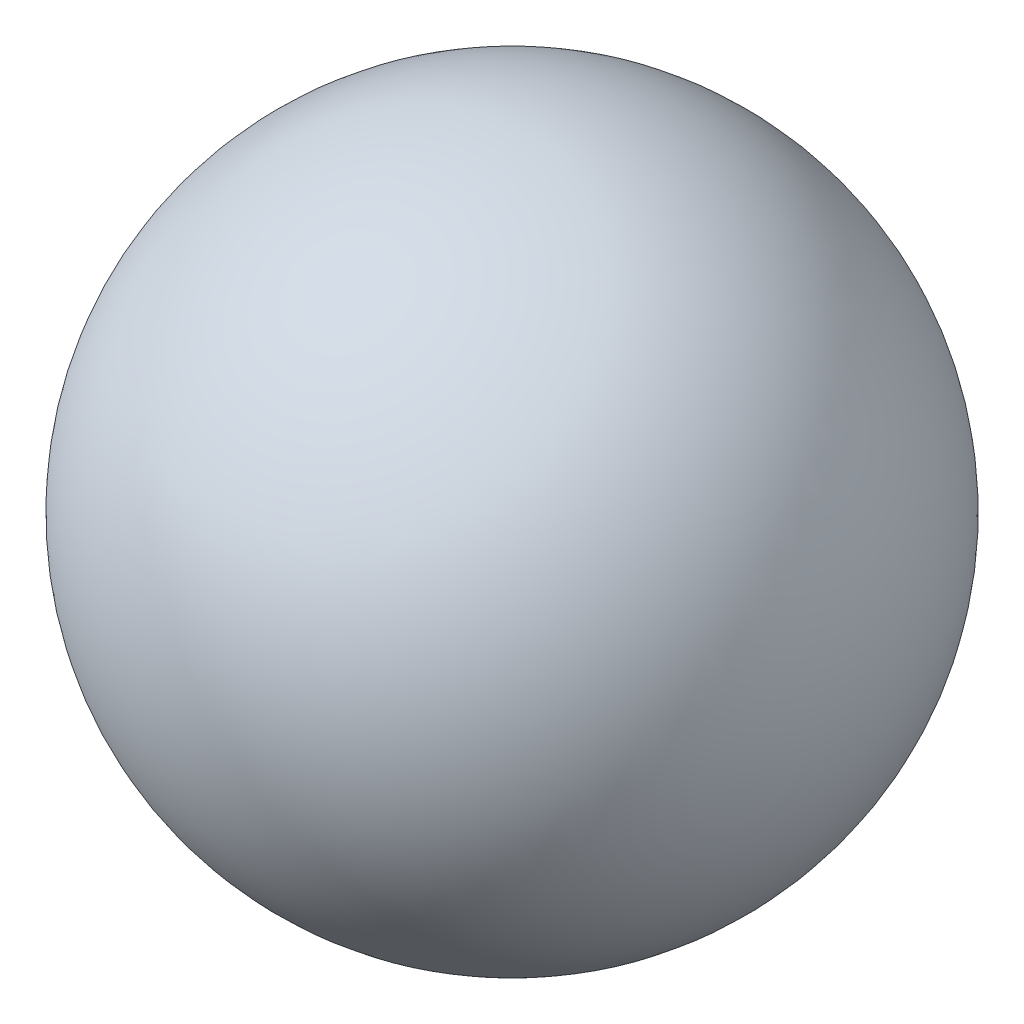
ISO-10303-21;
HEADER;
FILE_DESCRIPTION(('STEP AP214'),'2;1');
FILE_NAME('part.step','',(''),(''),'','','');
FILE_SCHEMA(('AUTOMOTIVE_DESIGN { 1 0 10303 214 1 1 1 1 }'));
ENDSEC;
DATA;
#1=APPLICATION_CONTEXT('core data for automotive mechanical design processes');
#2=APPLICATION_PROTOCOL_DEFINITION('international standard','automotive_design',2000,#1);
#3=PRODUCT_CONTEXT('',#1,'mechanical');
#4=PRODUCT('Part','Part','',(#3));
#5=PRODUCT_RELATED_PRODUCT_CATEGORY('part','',(#4));
#6=PRODUCT_DEFINITION_FORMATION('','',#4);
#7=PRODUCT_DEFINITION_CONTEXT('part definition',#1,'design');
#8=PRODUCT_DEFINITION('design','',#6,#7);
#9=PRODUCT_DEFINITION_SHAPE('','',#8);
#10=(LENGTH_UNIT() NAMED_UNIT(*) SI_UNIT(.MILLI.,.METRE.));
#11=(NAMED_UNIT(*) PLANE_ANGLE_UNIT() SI_UNIT($,.RADIAN.));
#12=(NAMED_UNIT(*) SI_UNIT($,.STERADIAN.) SOLID_ANGLE_UNIT());
#13=UNCERTAINTY_MEASURE_WITH_UNIT(LENGTH_MEASURE(1.E-05),#10,'distance_accuracy_value','');
#14=(GEOMETRIC_REPRESENTATION_CONTEXT(3) GLOBAL_UNCERTAINTY_ASSIGNED_CONTEXT((#13)) GLOBAL_UNIT_ASSIGNED_CONTEXT((#10,
#11,#12)) REPRESENTATION_CONTEXT('',''));
#15=CARTESIAN_POINT('',(0.,0.,0.));
#16=DIRECTION('',(0.,0.,1.));
#17=DIRECTION('',(1.,0.,0.));
#18=AXIS2_PLACEMENT_3D('',#15,#16,#17);
#19=CARTESIAN_POINT('',(-2.86057615559,0.,-1.377580871698));
#20=DIRECTION('',(0.,-1.,0.));
#21=DIRECTION('',(0.433883739117599,0.,-0.900968867902399));
#22=AXIS2_PLACEMENT_3D('',#19,#20,#21);
#23=SPHERICAL_SURFACE('',#22,0.794);
#24=CARTESIAN_POINT('',(-2.86057615559,-0.794,-1.377580871698));
#25=VERTEX_POINT('',#24);
#26=VERTEX_LOOP('',#25);
#27=FACE_BOUND('',#26,.T.);
#28=ADVANCED_FACE('F12',(#27),#23,.T.);
#29=CLOSED_SHELL('',(#28));
#30=MANIFOLD_SOLID_BREP('B1',#29);
#31=ADVANCED_BREP_SHAPE_REPRESENTATION('',(#18,#30),#14);
#32=SHAPE_DEFINITION_REPRESENTATION(#9,#31);
ENDSEC;
END-ISO-10303-21;
